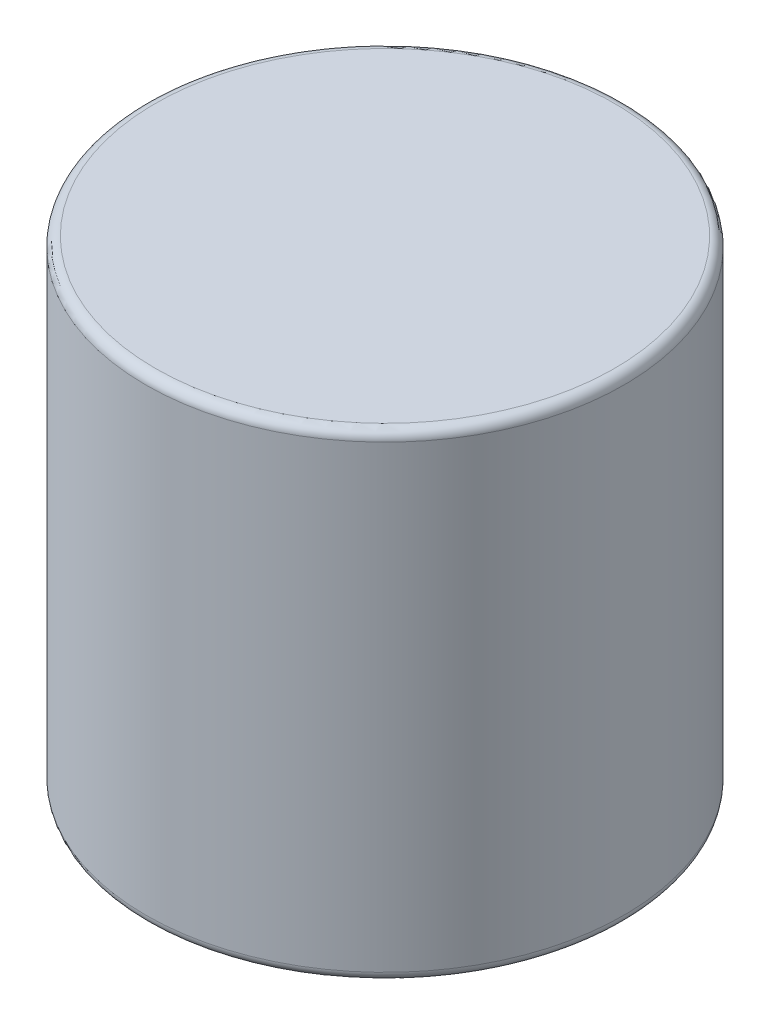
ISO-10303-21;
HEADER;
FILE_DESCRIPTION(('STEP AP214'),'2;1');
FILE_NAME('part.step','',(''),(''),'','','');
FILE_SCHEMA(('AUTOMOTIVE_DESIGN { 1 0 10303 214 1 1 1 1 }'));
ENDSEC;
DATA;
#1=APPLICATION_CONTEXT('core data for automotive mechanical design processes');
#2=APPLICATION_PROTOCOL_DEFINITION('international standard','automotive_design',2000,#1);
#3=PRODUCT_CONTEXT('',#1,'mechanical');
#4=PRODUCT('Part','Part','',(#3));
#5=PRODUCT_RELATED_PRODUCT_CATEGORY('part','',(#4));
#6=PRODUCT_DEFINITION_FORMATION('','',#4);
#7=PRODUCT_DEFINITION_CONTEXT('part definition',#1,'design');
#8=PRODUCT_DEFINITION('design','',#6,#7);
#9=PRODUCT_DEFINITION_SHAPE('','',#8);
#10=(LENGTH_UNIT() NAMED_UNIT(*) SI_UNIT(.MILLI.,.METRE.));
#11=(NAMED_UNIT(*) PLANE_ANGLE_UNIT() SI_UNIT($,.RADIAN.));
#12=(NAMED_UNIT(*) SI_UNIT($,.STERADIAN.) SOLID_ANGLE_UNIT());
#13=UNCERTAINTY_MEASURE_WITH_UNIT(LENGTH_MEASURE(1.E-05),#10,'distance_accuracy_value','');
#14=(GEOMETRIC_REPRESENTATION_CONTEXT(3) GLOBAL_UNCERTAINTY_ASSIGNED_CONTEXT((#13)) GLOBAL_UNIT_ASSIGNED_CONTEXT((#10,
#11,#12)) REPRESENTATION_CONTEXT('',''));
#15=CARTESIAN_POINT('',(0.,0.,0.));
#16=DIRECTION('',(0.,0.,1.));
#17=DIRECTION('',(1.,0.,0.));
#18=AXIS2_PLACEMENT_3D('',#15,#16,#17);
#19=CARTESIAN_POINT('',(0.,10.,0.));
#20=DIRECTION('',(0.,-1.,0.));
#21=DIRECTION('',(0.,0.,-1.));
#22=AXIS2_PLACEMENT_3D('',#19,#20,#21);
#23=CYLINDRICAL_SURFACE('',#22,5.);
#24=CARTESIAN_POINT('',(0.,0.200000000000001,0.));
#25=DIRECTION('',(0.,1.,0.));
#26=DIRECTION('',(0.,0.,1.));
#27=AXIS2_PLACEMENT_3D('',#24,#25,#26);
#28=CIRCLE('',#27,5.);
#29=CARTESIAN_POINT('',(0.,0.200000000000001,5.));
#30=VERTEX_POINT('',#29);
#31=EDGE_CURVE('E54',#30,#30,#28,.T.);
#32=ORIENTED_EDGE('',*,*,#31,.T.);
#33=EDGE_LOOP('',(#32));
#34=FACE_BOUND('',#33,.T.);
#35=CARTESIAN_POINT('',(0.,9.8,0.));
#36=DIRECTION('',(0.,1.,0.));
#37=DIRECTION('',(0.,0.,1.));
#38=AXIS2_PLACEMENT_3D('',#35,#36,#37);
#39=CIRCLE('',#38,5.);
#40=CARTESIAN_POINT('',(0.,9.8,5.));
#41=VERTEX_POINT('',#40);
#42=EDGE_CURVE('E59',#41,#41,#39,.F.);
#43=ORIENTED_EDGE('',*,*,#42,.T.);
#44=EDGE_LOOP('',(#43));
#45=FACE_BOUND('',#44,.T.);
#46=ADVANCED_FACE('F41',(#34,#45),#23,.T.);
#47=CARTESIAN_POINT('',(0.,10.,0.));
#48=DIRECTION('',(0.,1.,0.));
#49=DIRECTION('',(0.,0.,1.));
#50=AXIS2_PLACEMENT_3D('',#47,#48,#49);
#51=PLANE('',#50);
#52=CARTESIAN_POINT('',(0.,10.,0.));
#53=DIRECTION('',(0.,1.,0.));
#54=DIRECTION('',(0.,0.,1.));
#55=AXIS2_PLACEMENT_3D('',#52,#53,#54);
#56=CIRCLE('',#55,4.8);
#57=CARTESIAN_POINT('',(0.,10.,4.8));
#58=VERTEX_POINT('',#57);
#59=EDGE_CURVE('E10',#58,#58,#56,.T.);
#60=ORIENTED_EDGE('',*,*,#59,.T.);
#61=EDGE_LOOP('',(#60));
#62=FACE_BOUND('',#61,.T.);
#63=ADVANCED_FACE('F76',(#62),#51,.T.);
#64=CARTESIAN_POINT('',(0.,0.,0.));
#65=DIRECTION('',(0.,1.,0.));
#66=DIRECTION('',(0.,0.,1.));
#67=AXIS2_PLACEMENT_3D('',#64,#65,#66);
#68=PLANE('',#67);
#69=CARTESIAN_POINT('',(0.,0.,0.));
#70=DIRECTION('',(0.,1.,0.));
#71=DIRECTION('',(0.,0.,1.));
#72=AXIS2_PLACEMENT_3D('',#69,#70,#71);
#73=CIRCLE('',#72,4.8);
#74=CARTESIAN_POINT('',(0.,0.,4.8));
#75=VERTEX_POINT('',#74);
#76=EDGE_CURVE('E49',#75,#75,#73,.F.);
#77=ORIENTED_EDGE('',*,*,#76,.T.);
#78=EDGE_LOOP('',(#77));
#79=FACE_BOUND('',#78,.T.);
#80=ADVANCED_FACE('F73',(#79),#68,.F.);
#81=CARTESIAN_POINT('',(0.,0.200000000000001,0.));
#82=DIRECTION('',(0.,1.,0.));
#83=DIRECTION('',(0.,0.,1.));
#84=AXIS2_PLACEMENT_3D('',#81,#82,#83);
#85=TOROIDAL_SURFACE('',#84,4.8,0.2);
#86=ORIENTED_EDGE('',*,*,#76,.F.);
#87=EDGE_LOOP('',(#86));
#88=FACE_BOUND('',#87,.T.);
#89=ORIENTED_EDGE('',*,*,#31,.F.);
#90=EDGE_LOOP('',(#89));
#91=FACE_BOUND('',#90,.T.);
#92=ADVANCED_FACE('F69',(#88,#91),#85,.T.);
#93=CARTESIAN_POINT('',(0.,9.8,0.));
#94=DIRECTION('',(0.,1.,0.));
#95=DIRECTION('',(0.,0.,1.));
#96=AXIS2_PLACEMENT_3D('',#93,#94,#95);
#97=TOROIDAL_SURFACE('',#96,4.8,0.2);
#98=ORIENTED_EDGE('',*,*,#42,.F.);
#99=EDGE_LOOP('',(#98));
#100=FACE_BOUND('',#99,.T.);
#101=ORIENTED_EDGE('',*,*,#59,.F.);
#102=EDGE_LOOP('',(#101));
#103=FACE_BOUND('',#102,.T.);
#104=ADVANCED_FACE('F43',(#100,#103),#97,.T.);
#105=CLOSED_SHELL('',(#46,#63,#80,#92,#104));
#106=MANIFOLD_SOLID_BREP('B2',#105);
#107=ADVANCED_BREP_SHAPE_REPRESENTATION('',(#18,#106),#14);
#108=SHAPE_DEFINITION_REPRESENTATION(#9,#107);
ENDSEC;
END-ISO-10303-21;
